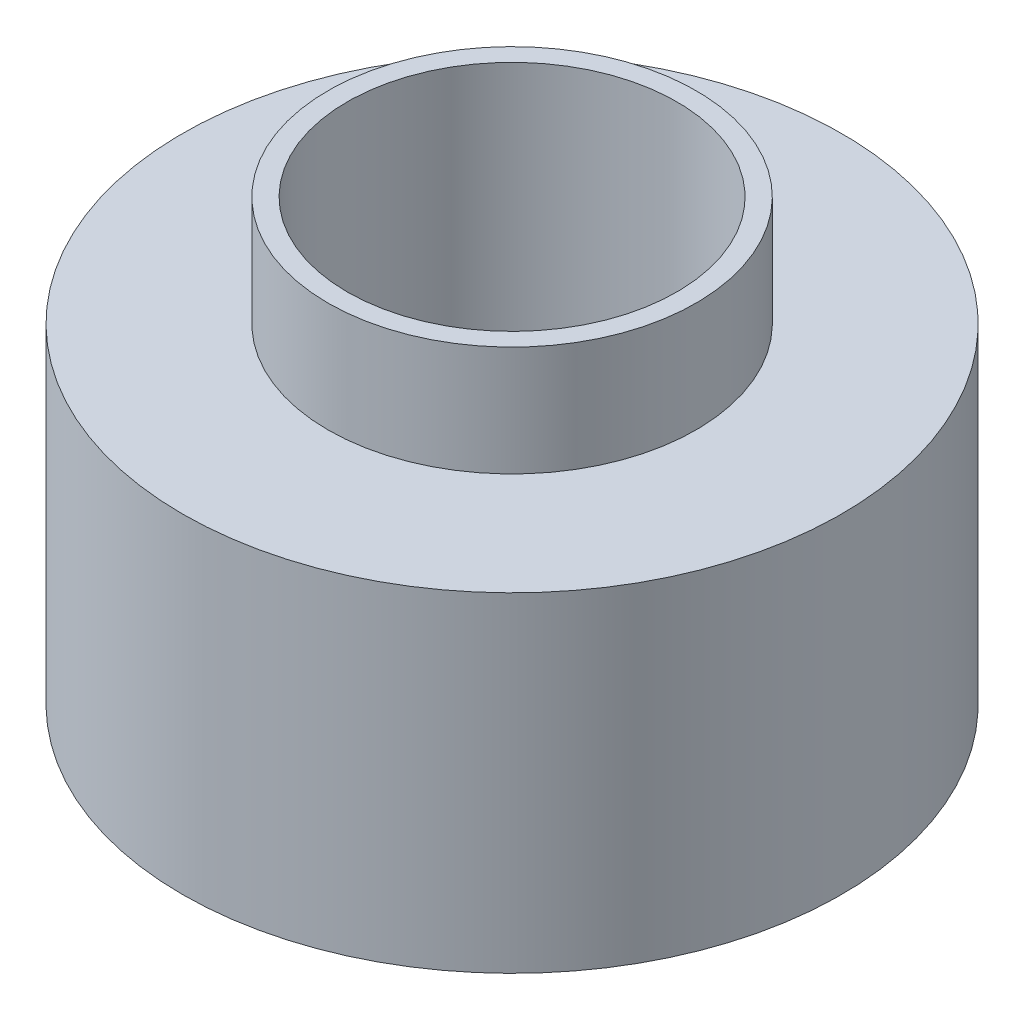
ISO-10303-21;
HEADER;
FILE_DESCRIPTION(('STEP AP214'),'2;1');
FILE_NAME('part.step','',(''),(''),'','','');
FILE_SCHEMA(('AUTOMOTIVE_DESIGN { 1 0 10303 214 1 1 1 1 }'));
ENDSEC;
DATA;
#1=APPLICATION_CONTEXT('core data for automotive mechanical design processes');
#2=APPLICATION_PROTOCOL_DEFINITION('international standard','automotive_design',2000,#1);
#3=PRODUCT_CONTEXT('',#1,'mechanical');
#4=PRODUCT('Part','Part','',(#3));
#5=PRODUCT_RELATED_PRODUCT_CATEGORY('part','',(#4));
#6=PRODUCT_DEFINITION_FORMATION('','',#4);
#7=PRODUCT_DEFINITION_CONTEXT('part definition',#1,'design');
#8=PRODUCT_DEFINITION('design','',#6,#7);
#9=PRODUCT_DEFINITION_SHAPE('','',#8);
#10=(LENGTH_UNIT() NAMED_UNIT(*) SI_UNIT(.MILLI.,.METRE.));
#11=(NAMED_UNIT(*) PLANE_ANGLE_UNIT() SI_UNIT($,.RADIAN.));
#12=(NAMED_UNIT(*) SI_UNIT($,.STERADIAN.) SOLID_ANGLE_UNIT());
#13=UNCERTAINTY_MEASURE_WITH_UNIT(LENGTH_MEASURE(1.E-05),#10,'distance_accuracy_value','');
#14=(GEOMETRIC_REPRESENTATION_CONTEXT(3) GLOBAL_UNCERTAINTY_ASSIGNED_CONTEXT((#13)) GLOBAL_UNIT_ASSIGNED_CONTEXT((#10,
#11,#12)) REPRESENTATION_CONTEXT('',''));
#15=CARTESIAN_POINT('',(0.,0.,0.));
#16=DIRECTION('',(0.,0.,1.));
#17=DIRECTION('',(1.,0.,0.));
#18=AXIS2_PLACEMENT_3D('',#15,#16,#17);
#19=CARTESIAN_POINT('',(-3.46944695195361E-13,12.7,0.));
#20=DIRECTION('',(0.,1.,0.));
#21=DIRECTION('',(0.,0.,1.));
#22=AXIS2_PLACEMENT_3D('',#19,#20,#21);
#23=PLANE('',#22);
#24=CARTESIAN_POINT('',(-3.60822483003176E-13,12.7,0.));
#25=DIRECTION('',(0.,1.,0.));
#26=DIRECTION('',(0.,0.,1.));
#27=AXIS2_PLACEMENT_3D('',#24,#25,#26);
#28=CIRCLE('',#27,4.7625);
#29=CARTESIAN_POINT('',(-3.60822483003176E-13,12.7,4.7625));
#30=VERTEX_POINT('',#29);
#31=EDGE_CURVE('E75',#30,#30,#28,.T.);
#32=ORIENTED_EDGE('',*,*,#31,.F.);
#33=EDGE_LOOP('',(#32));
#34=FACE_BOUND('',#33,.T.);
#35=CARTESIAN_POINT('',(-3.60822483003176E-13,12.7,0.));
#36=DIRECTION('',(0.,1.,0.));
#37=DIRECTION('',(0.,0.,1.));
#38=AXIS2_PLACEMENT_3D('',#35,#36,#37);
#39=CIRCLE('',#38,5.31849762370951);
#40=CARTESIAN_POINT('',(-3.60822483003176E-13,12.7,5.31849762370951));
#41=VERTEX_POINT('',#40);
#42=EDGE_CURVE('E12',#41,#41,#39,.T.);
#43=ORIENTED_EDGE('',*,*,#42,.T.);
#44=EDGE_LOOP('',(#43));
#45=FACE_BOUND('',#44,.T.);
#46=ADVANCED_FACE('F50',(#34,#45),#23,.T.);
#47=CARTESIAN_POINT('',(0.,75.7913777244551,0.));
#48=DIRECTION('',(0.,1.,0.));
#49=DIRECTION('',(0.,0.,1.));
#50=AXIS2_PLACEMENT_3D('',#47,#48,#49);
#51=CYLINDRICAL_SURFACE('',#50,5.31849762370951);
#52=CARTESIAN_POINT('',(-3.60822483003176E-13,9.52500000000001,0.));
#53=DIRECTION('',(0.,1.,0.));
#54=DIRECTION('',(0.,0.,1.));
#55=AXIS2_PLACEMENT_3D('',#52,#53,#54);
#56=CIRCLE('',#55,5.31849762370951);
#57=CARTESIAN_POINT('',(-3.60822483003176E-13,9.52500000000001,5.31849762370951));
#58=VERTEX_POINT('',#57);
#59=EDGE_CURVE('E57',#58,#58,#56,.T.);
#60=ORIENTED_EDGE('',*,*,#59,.T.);
#61=EDGE_LOOP('',(#60));
#62=FACE_BOUND('',#61,.T.);
#63=ORIENTED_EDGE('',*,*,#42,.F.);
#64=EDGE_LOOP('',(#63));
#65=FACE_BOUND('',#64,.T.);
#66=ADVANCED_FACE('F98',(#62,#65),#51,.T.);
#67=CARTESIAN_POINT('',(-5.31849762370987,9.52500000000001,0.));
#68=DIRECTION('',(0.,1.,0.));
#69=DIRECTION('',(0.,0.,1.));
#70=AXIS2_PLACEMENT_3D('',#67,#68,#69);
#71=PLANE('',#70);
#72=CARTESIAN_POINT('',(-3.60822483003176E-13,9.52500000000001,0.));
#73=DIRECTION('',(0.,1.,0.));
#74=DIRECTION('',(0.,0.,1.));
#75=AXIS2_PLACEMENT_3D('',#72,#73,#74);
#76=CIRCLE('',#75,9.525);
#77=CARTESIAN_POINT('',(-3.60822483003176E-13,9.52500000000001,9.525));
#78=VERTEX_POINT('',#77);
#79=EDGE_CURVE('E63',#78,#78,#76,.T.);
#80=ORIENTED_EDGE('',*,*,#79,.T.);
#81=EDGE_LOOP('',(#80));
#82=FACE_BOUND('',#81,.T.);
#83=ORIENTED_EDGE('',*,*,#59,.F.);
#84=EDGE_LOOP('',(#83));
#85=FACE_BOUND('',#84,.T.);
#86=ADVANCED_FACE('F103',(#82,#85),#71,.T.);
#87=CARTESIAN_POINT('',(0.,75.7913777244551,0.));
#88=DIRECTION('',(0.,1.,0.));
#89=DIRECTION('',(0.,0.,1.));
#90=AXIS2_PLACEMENT_3D('',#87,#88,#89);
#91=CYLINDRICAL_SURFACE('',#90,9.525);
#92=CARTESIAN_POINT('',(0.,0.,0.));
#93=DIRECTION('',(0.,1.,0.));
#94=DIRECTION('',(0.,0.,1.));
#95=AXIS2_PLACEMENT_3D('',#92,#93,#94);
#96=CIRCLE('',#95,9.52499999999999);
#97=CARTESIAN_POINT('',(0.,0.,9.52499999999999));
#98=VERTEX_POINT('',#97);
#99=EDGE_CURVE('E69',#98,#98,#96,.T.);
#100=ORIENTED_EDGE('',*,*,#99,.T.);
#101=EDGE_LOOP('',(#100));
#102=FACE_BOUND('',#101,.T.);
#103=ORIENTED_EDGE('',*,*,#79,.F.);
#104=EDGE_LOOP('',(#103));
#105=FACE_BOUND('',#104,.T.);
#106=ADVANCED_FACE('F95',(#102,#105),#91,.T.);
#107=CARTESIAN_POINT('',(-9.52500000000015,0.,0.));
#108=DIRECTION('',(0.,-1.,0.));
#109=DIRECTION('',(0.,0.,-1.));
#110=AXIS2_PLACEMENT_3D('',#107,#108,#109);
#111=PLANE('',#110);
#112=CARTESIAN_POINT('',(0.,0.,0.));
#113=DIRECTION('',(0.,1.,0.));
#114=DIRECTION('',(0.,0.,1.));
#115=AXIS2_PLACEMENT_3D('',#112,#113,#114);
#116=CIRCLE('',#115,4.7625);
#117=CARTESIAN_POINT('',(0.,0.,4.7625));
#118=VERTEX_POINT('',#117);
#119=EDGE_CURVE('E79',#118,#118,#116,.T.);
#120=ORIENTED_EDGE('',*,*,#119,.T.);
#121=EDGE_LOOP('',(#120));
#122=FACE_BOUND('',#121,.T.);
#123=ORIENTED_EDGE('',*,*,#99,.F.);
#124=EDGE_LOOP('',(#123));
#125=FACE_BOUND('',#124,.T.);
#126=ADVANCED_FACE('F85',(#122,#125),#111,.T.);
#127=CARTESIAN_POINT('',(0.,0.,0.));
#128=DIRECTION('',(0.,1.,0.));
#129=DIRECTION('',(0.,0.,1.));
#130=AXIS2_PLACEMENT_3D('',#127,#128,#129);
#131=CYLINDRICAL_SURFACE('',#130,4.7625);
#132=ORIENTED_EDGE('',*,*,#31,.T.);
#133=EDGE_LOOP('',(#132));
#134=FACE_BOUND('',#133,.T.);
#135=ORIENTED_EDGE('',*,*,#119,.F.);
#136=EDGE_LOOP('',(#135));
#137=FACE_BOUND('',#136,.T.);
#138=ADVANCED_FACE('F88',(#134,#137),#131,.F.);
#139=CLOSED_SHELL('',(#46,#66,#86,#106,#126,#138));
#140=MANIFOLD_SOLID_BREP('B2',#139);
#141=ADVANCED_BREP_SHAPE_REPRESENTATION('',(#18,#140),#14);
#142=SHAPE_DEFINITION_REPRESENTATION(#9,#141);
ENDSEC;
END-ISO-10303-21;
